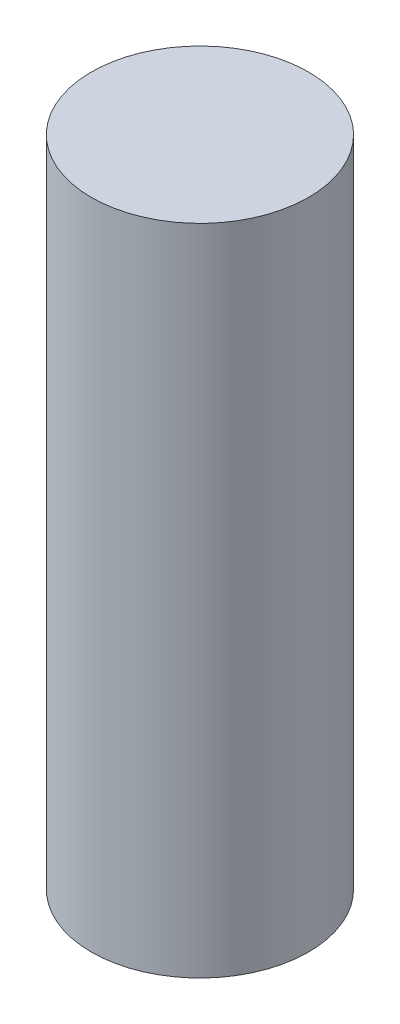
ISO-10303-21;
HEADER;
FILE_DESCRIPTION(('STEP AP214'),'2;1');
FILE_NAME('part.step','',(''),(''),'','','');
FILE_SCHEMA(('AUTOMOTIVE_DESIGN { 1 0 10303 214 1 1 1 1 }'));
ENDSEC;
DATA;
#1=APPLICATION_CONTEXT('core data for automotive mechanical design processes');
#2=APPLICATION_PROTOCOL_DEFINITION('international standard','automotive_design',2000,#1);
#3=PRODUCT_CONTEXT('',#1,'mechanical');
#4=PRODUCT('Part','Part','',(#3));
#5=PRODUCT_RELATED_PRODUCT_CATEGORY('part','',(#4));
#6=PRODUCT_DEFINITION_FORMATION('','',#4);
#7=PRODUCT_DEFINITION_CONTEXT('part definition',#1,'design');
#8=PRODUCT_DEFINITION('design','',#6,#7);
#9=PRODUCT_DEFINITION_SHAPE('','',#8);
#10=(LENGTH_UNIT() NAMED_UNIT(*) SI_UNIT(.MILLI.,.METRE.));
#11=(NAMED_UNIT(*) PLANE_ANGLE_UNIT() SI_UNIT($,.RADIAN.));
#12=(NAMED_UNIT(*) SI_UNIT($,.STERADIAN.) SOLID_ANGLE_UNIT());
#13=UNCERTAINTY_MEASURE_WITH_UNIT(LENGTH_MEASURE(1.E-05),#10,'distance_accuracy_value','');
#14=(GEOMETRIC_REPRESENTATION_CONTEXT(3) GLOBAL_UNCERTAINTY_ASSIGNED_CONTEXT((#13)) GLOBAL_UNIT_ASSIGNED_CONTEXT((#10,
#11,#12)) REPRESENTATION_CONTEXT('',''));
#15=CARTESIAN_POINT('',(0.,0.,0.));
#16=DIRECTION('',(0.,0.,1.));
#17=DIRECTION('',(1.,0.,0.));
#18=AXIS2_PLACEMENT_3D('',#15,#16,#17);
#19=CARTESIAN_POINT('',(0.,4.7752,0.));
#20=DIRECTION('',(0.,-1.,0.));
#21=DIRECTION('',(0.,0.,-1.));
#22=AXIS2_PLACEMENT_3D('',#19,#20,#21);
#23=PLANE('',#22);
#24=CARTESIAN_POINT('',(0.,4.7752,0.));
#25=DIRECTION('',(0.,1.,0.));
#26=DIRECTION('',(0.,0.,1.));
#27=AXIS2_PLACEMENT_3D('',#24,#25,#26);
#28=CIRCLE('',#27,0.79375);
#29=CARTESIAN_POINT('',(0.,4.7752,0.793749999999995));
#30=VERTEX_POINT('',#29);
#31=EDGE_CURVE('E10',#30,#30,#28,.T.);
#32=ORIENTED_EDGE('',*,*,#31,.T.);
#33=EDGE_LOOP('',(#32));
#34=FACE_BOUND('',#33,.T.);
#35=ADVANCED_FACE('F31',(#34),#23,.F.);
#36=CARTESIAN_POINT('',(0.,48.6262727964066,0.));
#37=DIRECTION('',(0.,1.,0.));
#38=DIRECTION('',(0.,0.,1.));
#39=AXIS2_PLACEMENT_3D('',#36,#37,#38);
#40=CYLINDRICAL_SURFACE('',#39,0.79375);
#41=ORIENTED_EDGE('',*,*,#31,.F.);
#42=EDGE_LOOP('',(#41));
#43=FACE_BOUND('',#42,.T.);
#44=CARTESIAN_POINT('',(0.,0.,0.));
#45=DIRECTION('',(0.,1.,0.));
#46=DIRECTION('',(0.,0.,1.));
#47=AXIS2_PLACEMENT_3D('',#44,#45,#46);
#48=CIRCLE('',#47,0.79375);
#49=CARTESIAN_POINT('',(0.,0.,0.793749999999994));
#50=VERTEX_POINT('',#49);
#51=EDGE_CURVE('E37',#50,#50,#48,.T.);
#52=ORIENTED_EDGE('',*,*,#51,.T.);
#53=EDGE_LOOP('',(#52));
#54=FACE_BOUND('',#53,.T.);
#55=ADVANCED_FACE('F43',(#43,#54),#40,.T.);
#56=CARTESIAN_POINT('',(0.,0.,0.));
#57=DIRECTION('',(0.,1.,0.));
#58=DIRECTION('',(0.,0.,1.));
#59=AXIS2_PLACEMENT_3D('',#56,#57,#58);
#60=PLANE('',#59);
#61=ORIENTED_EDGE('',*,*,#51,.F.);
#62=EDGE_LOOP('',(#61));
#63=FACE_BOUND('',#62,.T.);
#64=ADVANCED_FACE('F45',(#63),#60,.F.);
#65=CLOSED_SHELL('',(#35,#55,#64));
#66=MANIFOLD_SOLID_BREP('B2',#65);
#67=ADVANCED_BREP_SHAPE_REPRESENTATION('',(#18,#66),#14);
#68=SHAPE_DEFINITION_REPRESENTATION(#9,#67);
ENDSEC;
END-ISO-10303-21;
